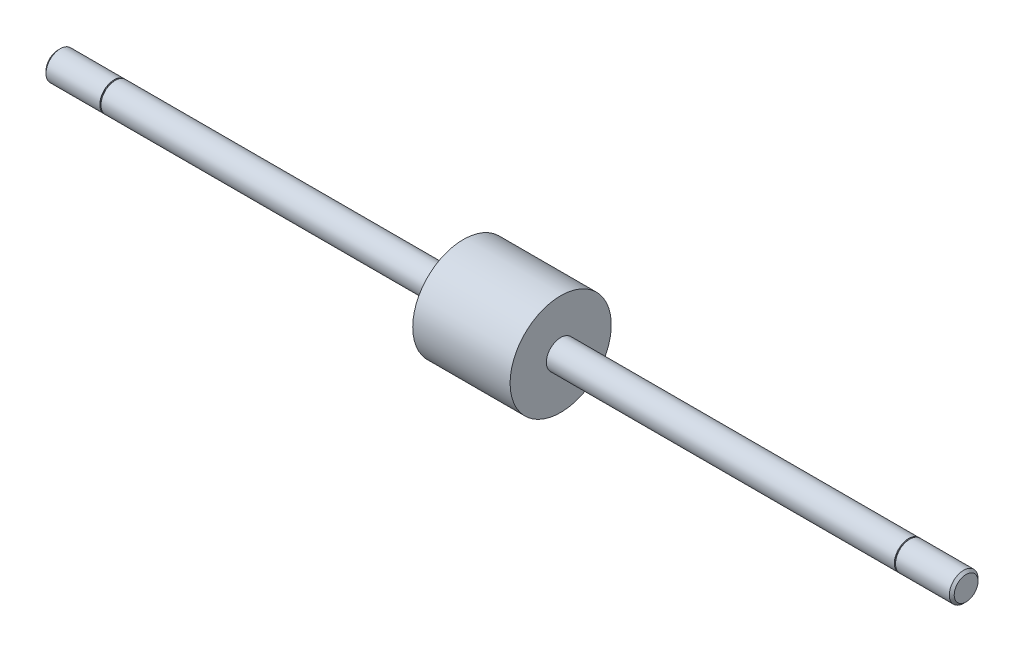
ISO-10303-21;
HEADER;
FILE_DESCRIPTION(('STEP AP214'),'2;1');
FILE_NAME('part.step','',(''),(''),'','','');
FILE_SCHEMA(('AUTOMOTIVE_DESIGN { 1 0 10303 214 1 1 1 1 }'));
ENDSEC;
DATA;
#1=APPLICATION_CONTEXT('core data for automotive mechanical design processes');
#2=APPLICATION_PROTOCOL_DEFINITION('international standard','automotive_design',2000,#1);
#3=PRODUCT_CONTEXT('',#1,'mechanical');
#4=PRODUCT('Part','Part','',(#3));
#5=PRODUCT_RELATED_PRODUCT_CATEGORY('part','',(#4));
#6=PRODUCT_DEFINITION_FORMATION('','',#4);
#7=PRODUCT_DEFINITION_CONTEXT('part definition',#1,'design');
#8=PRODUCT_DEFINITION('design','',#6,#7);
#9=PRODUCT_DEFINITION_SHAPE('','',#8);
#10=(LENGTH_UNIT() NAMED_UNIT(*) SI_UNIT(.MILLI.,.METRE.));
#11=(NAMED_UNIT(*) PLANE_ANGLE_UNIT() SI_UNIT($,.RADIAN.));
#12=(NAMED_UNIT(*) SI_UNIT($,.STERADIAN.) SOLID_ANGLE_UNIT());
#13=UNCERTAINTY_MEASURE_WITH_UNIT(LENGTH_MEASURE(1.E-05),#10,'distance_accuracy_value','');
#14=(GEOMETRIC_REPRESENTATION_CONTEXT(3) GLOBAL_UNCERTAINTY_ASSIGNED_CONTEXT((#13)) GLOBAL_UNIT_ASSIGNED_CONTEXT((#10,
#11,#12)) REPRESENTATION_CONTEXT('',''));
#15=CARTESIAN_POINT('',(0.,0.,0.));
#16=DIRECTION('',(0.,0.,1.));
#17=DIRECTION('',(1.,0.,0.));
#18=AXIS2_PLACEMENT_3D('',#15,#16,#17);
#19=CARTESIAN_POINT('',(175.514,0.,0.));
#20=DIRECTION('',(-1.,0.,0.));
#21=DIRECTION('',(0.,0.,1.));
#22=AXIS2_PLACEMENT_3D('',#19,#20,#21);
#23=CYLINDRICAL_SURFACE('',#22,3.175);
#24=CARTESIAN_POINT('',(98.5266,0.,0.));
#25=DIRECTION('',(-1.,0.,0.));
#26=DIRECTION('',(0.,0.,1.));
#27=AXIS2_PLACEMENT_3D('',#24,#25,#26);
#28=CIRCLE('',#27,3.175);
#29=CARTESIAN_POINT('',(98.5266,0.,3.175));
#30=VERTEX_POINT('',#29);
#31=EDGE_CURVE('E10',#30,#30,#28,.F.);
#32=ORIENTED_EDGE('',*,*,#31,.T.);
#33=EDGE_LOOP('',(#32));
#34=FACE_BOUND('',#33,.T.);
#35=CARTESIAN_POINT('',(175.514,0.,0.));
#36=DIRECTION('',(1.,0.,0.));
#37=DIRECTION('',(0.,0.,-1.));
#38=AXIS2_PLACEMENT_3D('',#35,#36,#37);
#39=CIRCLE('',#38,3.175);
#40=CARTESIAN_POINT('',(175.514,0.,-3.175));
#41=VERTEX_POINT('',#40);
#42=EDGE_CURVE('E40',#41,#41,#39,.T.);
#43=ORIENTED_EDGE('',*,*,#42,.F.);
#44=EDGE_LOOP('',(#43));
#45=FACE_BOUND('',#44,.T.);
#46=ADVANCED_FACE('F36',(#34,#45),#23,.T.);
#47=CARTESIAN_POINT('',(98.5266,0.,0.));
#48=DIRECTION('',(-1.,0.,0.));
#49=DIRECTION('',(0.,0.,1.));
#50=AXIS2_PLACEMENT_3D('',#47,#48,#49);
#51=CYLINDRICAL_SURFACE('',#50,3.175);
#52=CARTESIAN_POINT('',(76.9874,0.,0.));
#53=DIRECTION('',(-1.,0.,0.));
#54=DIRECTION('',(0.,0.,1.));
#55=AXIS2_PLACEMENT_3D('',#52,#53,#54);
#56=CIRCLE('',#55,3.175);
#57=CARTESIAN_POINT('',(76.9874,0.,3.175));
#58=VERTEX_POINT('',#57);
#59=EDGE_CURVE('E44',#58,#58,#56,.T.);
#60=ORIENTED_EDGE('',*,*,#59,.T.);
#61=EDGE_LOOP('',(#60));
#62=FACE_BOUND('',#61,.T.);
#63=CARTESIAN_POINT('',(0.,0.,0.));
#64=DIRECTION('',(-1.,0.,0.));
#65=DIRECTION('',(0.,0.,1.));
#66=AXIS2_PLACEMENT_3D('',#63,#64,#65);
#67=CIRCLE('',#66,3.175);
#68=CARTESIAN_POINT('',(0.,0.,3.175));
#69=VERTEX_POINT('',#68);
#70=EDGE_CURVE('E53',#69,#69,#67,.T.);
#71=ORIENTED_EDGE('',*,*,#70,.F.);
#72=EDGE_LOOP('',(#71));
#73=FACE_BOUND('',#72,.T.);
#74=ADVANCED_FACE('F107',(#62,#73),#51,.T.);
#75=CARTESIAN_POINT('',(98.5266,11.19505,0.));
#76=DIRECTION('',(-1.,0.,0.));
#77=DIRECTION('',(0.,0.,1.));
#78=AXIS2_PLACEMENT_3D('',#75,#76,#77);
#79=PLANE('',#78);
#80=CARTESIAN_POINT('',(98.5266,0.,0.));
#81=DIRECTION('',(-1.,0.,0.));
#82=DIRECTION('',(0.,0.,1.));
#83=AXIS2_PLACEMENT_3D('',#80,#81,#82);
#84=CIRCLE('',#83,11.19505);
#85=CARTESIAN_POINT('',(98.5266,0.,11.19505));
#86=VERTEX_POINT('',#85);
#87=EDGE_CURVE('E90',#86,#86,#84,.T.);
#88=ORIENTED_EDGE('',*,*,#87,.F.);
#89=EDGE_LOOP('',(#88));
#90=FACE_BOUND('',#89,.T.);
#91=ORIENTED_EDGE('',*,*,#31,.F.);
#92=EDGE_LOOP('',(#91));
#93=FACE_BOUND('',#92,.T.);
#94=ADVANCED_FACE('F104',(#90,#93),#79,.F.);
#95=CARTESIAN_POINT('',(76.9874,3.175,0.));
#96=DIRECTION('',(1.,0.,0.));
#97=DIRECTION('',(0.,0.,-1.));
#98=AXIS2_PLACEMENT_3D('',#95,#96,#97);
#99=PLANE('',#98);
#100=ORIENTED_EDGE('',*,*,#59,.F.);
#101=EDGE_LOOP('',(#100));
#102=FACE_BOUND('',#101,.T.);
#103=CARTESIAN_POINT('',(76.9874,0.,0.));
#104=DIRECTION('',(-1.,0.,0.));
#105=DIRECTION('',(0.,0.,1.));
#106=AXIS2_PLACEMENT_3D('',#103,#104,#105);
#107=CIRCLE('',#106,11.19505);
#108=CARTESIAN_POINT('',(76.9874,0.,11.19505));
#109=VERTEX_POINT('',#108);
#110=EDGE_CURVE('E49',#109,#109,#107,.T.);
#111=ORIENTED_EDGE('',*,*,#110,.T.);
#112=EDGE_LOOP('',(#111));
#113=FACE_BOUND('',#112,.T.);
#114=ADVANCED_FACE('F95',(#102,#113),#99,.F.);
#115=CARTESIAN_POINT('',(98.5266,0.,0.));
#116=DIRECTION('',(-1.,0.,0.));
#117=DIRECTION('',(0.,0.,1.));
#118=AXIS2_PLACEMENT_3D('',#115,#116,#117);
#119=CYLINDRICAL_SURFACE('',#118,11.19505);
#120=ORIENTED_EDGE('',*,*,#110,.F.);
#121=EDGE_LOOP('',(#120));
#122=FACE_BOUND('',#121,.T.);
#123=ORIENTED_EDGE('',*,*,#87,.T.);
#124=EDGE_LOOP('',(#123));
#125=FACE_BOUND('',#124,.T.);
#126=ADVANCED_FACE('F97',(#122,#125),#119,.T.);
#127=CARTESIAN_POINT('',(-0.254,3.429,0.));
#128=DIRECTION('',(1.,0.,0.));
#129=DIRECTION('',(0.,0.,-1.));
#130=AXIS2_PLACEMENT_3D('',#127,#128,#129);
#131=PLANE('',#130);
#132=CARTESIAN_POINT('',(-0.254,0.,0.));
#133=DIRECTION('',(-1.,0.,0.));
#134=DIRECTION('',(0.,0.,1.));
#135=AXIS2_PLACEMENT_3D('',#132,#133,#134);
#136=CIRCLE('',#135,2.921);
#137=CARTESIAN_POINT('',(-0.254,0.,2.921));
#138=VERTEX_POINT('',#137);
#139=EDGE_CURVE('E57',#138,#138,#136,.T.);
#140=ORIENTED_EDGE('',*,*,#139,.T.);
#141=EDGE_LOOP('',(#140));
#142=FACE_BOUND('',#141,.T.);
#143=CARTESIAN_POINT('',(-0.254000000000004,0.,0.));
#144=DIRECTION('',(1.,0.,0.));
#145=DIRECTION('',(0.,0.,-1.));
#146=AXIS2_PLACEMENT_3D('',#143,#144,#145);
#147=CIRCLE('',#146,3.175);
#148=CARTESIAN_POINT('',(-0.254000000000004,0.,-3.175));
#149=VERTEX_POINT('',#148);
#150=EDGE_CURVE('E56',#149,#149,#147,.T.);
#151=ORIENTED_EDGE('',*,*,#150,.T.);
#152=EDGE_LOOP('',(#151));
#153=FACE_BOUND('',#152,.T.);
#154=ADVANCED_FACE('F100',(#142,#153),#131,.T.);
#155=CARTESIAN_POINT('',(0.,2.921,0.));
#156=DIRECTION('',(-1.,0.,0.));
#157=DIRECTION('',(0.,0.,1.));
#158=AXIS2_PLACEMENT_3D('',#155,#156,#157);
#159=PLANE('',#158);
#160=CARTESIAN_POINT('',(0.,0.,0.));
#161=DIRECTION('',(-1.,0.,0.));
#162=DIRECTION('',(0.,0.,1.));
#163=AXIS2_PLACEMENT_3D('',#160,#161,#162);
#164=CIRCLE('',#163,2.921);
#165=CARTESIAN_POINT('',(0.,0.,2.921));
#166=VERTEX_POINT('',#165);
#167=EDGE_CURVE('E66',#166,#166,#164,.T.);
#168=ORIENTED_EDGE('',*,*,#167,.F.);
#169=EDGE_LOOP('',(#168));
#170=FACE_BOUND('',#169,.T.);
#171=ORIENTED_EDGE('',*,*,#70,.T.);
#172=EDGE_LOOP('',(#171));
#173=FACE_BOUND('',#172,.T.);
#174=ADVANCED_FACE('F149',(#170,#173),#159,.T.);
#175=CARTESIAN_POINT('',(0.,0.,0.));
#176=DIRECTION('',(-1.,0.,0.));
#177=DIRECTION('',(0.,0.,1.));
#178=AXIS2_PLACEMENT_3D('',#175,#176,#177);
#179=CYLINDRICAL_SURFACE('',#178,2.921);
#180=ORIENTED_EDGE('',*,*,#167,.T.);
#181=EDGE_LOOP('',(#180));
#182=FACE_BOUND('',#181,.T.);
#183=ORIENTED_EDGE('',*,*,#139,.F.);
#184=EDGE_LOOP('',(#183));
#185=FACE_BOUND('',#184,.T.);
#186=ADVANCED_FACE('F151',(#182,#185),#179,.T.);
#187=CARTESIAN_POINT('',(-12.7,0.,0.));
#188=DIRECTION('',(1.,0.,0.));
#189=DIRECTION('',(0.,0.,-1.));
#190=AXIS2_PLACEMENT_3D('',#187,#188,#189);
#191=PLANE('',#190);
#192=CARTESIAN_POINT('',(-12.7,0.,0.));
#193=DIRECTION('',(-1.,0.,0.));
#194=DIRECTION('',(0.,0.,1.));
#195=AXIS2_PLACEMENT_3D('',#192,#193,#194);
#196=CIRCLE('',#195,2.63398);
#197=CARTESIAN_POINT('',(-12.7,0.,2.63398));
#198=VERTEX_POINT('',#197);
#199=EDGE_CURVE('E87',#198,#198,#196,.T.);
#200=ORIENTED_EDGE('',*,*,#199,.T.);
#201=EDGE_LOOP('',(#200));
#202=FACE_BOUND('',#201,.T.);
#203=ADVANCED_FACE('F154',(#202),#191,.F.);
#204=CARTESIAN_POINT('',(-12.15898,0.,0.));
#205=DIRECTION('',(1.,0.,0.));
#206=DIRECTION('',(0.,0.,-1.));
#207=AXIS2_PLACEMENT_3D('',#204,#205,#206);
#208=CONICAL_SURFACE('',#207,3.175,0.785398163397448);
#209=ORIENTED_EDGE('',*,*,#199,.F.);
#210=EDGE_LOOP('',(#209));
#211=FACE_BOUND('',#210,.T.);
#212=CARTESIAN_POINT('',(-12.15898,0.,0.));
#213=DIRECTION('',(-1.,0.,0.));
#214=DIRECTION('',(0.,0.,1.));
#215=AXIS2_PLACEMENT_3D('',#212,#213,#214);
#216=CIRCLE('',#215,3.175);
#217=CARTESIAN_POINT('',(-12.15898,0.,3.175));
#218=VERTEX_POINT('',#217);
#219=EDGE_CURVE('E84',#218,#218,#216,.T.);
#220=ORIENTED_EDGE('',*,*,#219,.T.);
#221=EDGE_LOOP('',(#220));
#222=FACE_BOUND('',#221,.T.);
#223=ADVANCED_FACE('F219',(#211,#222),#208,.T.);
#224=ORIENTED_EDGE('',*,*,#219,.F.);
#225=EDGE_LOOP('',(#224));
#226=FACE_BOUND('',#225,.T.);
#227=ORIENTED_EDGE('',*,*,#150,.F.);
#228=EDGE_LOOP('',(#227));
#229=FACE_BOUND('',#228,.T.);
#230=ADVANCED_FACE('F38',(#226,#229),#51,.T.);
#231=CARTESIAN_POINT('',(175.514,3.429,0.));
#232=DIRECTION('',(1.,0.,0.));
#233=DIRECTION('',(0.,0.,-1.));
#234=AXIS2_PLACEMENT_3D('',#231,#232,#233);
#235=PLANE('',#234);
#236=CARTESIAN_POINT('',(175.514,0.,0.));
#237=DIRECTION('',(-1.,0.,0.));
#238=DIRECTION('',(0.,0.,1.));
#239=AXIS2_PLACEMENT_3D('',#236,#237,#238);
#240=CIRCLE('',#239,2.921);
#241=CARTESIAN_POINT('',(175.514,0.,2.921));
#242=VERTEX_POINT('',#241);
#243=EDGE_CURVE('E62',#242,#242,#240,.T.);
#244=ORIENTED_EDGE('',*,*,#243,.T.);
#245=EDGE_LOOP('',(#244));
#246=FACE_BOUND('',#245,.T.);
#247=ORIENTED_EDGE('',*,*,#42,.T.);
#248=EDGE_LOOP('',(#247));
#249=FACE_BOUND('',#248,.T.);
#250=ADVANCED_FACE('F159',(#246,#249),#235,.T.);
#251=CARTESIAN_POINT('',(175.768,2.921,0.));
#252=DIRECTION('',(-1.,0.,0.));
#253=DIRECTION('',(0.,0.,1.));
#254=AXIS2_PLACEMENT_3D('',#251,#252,#253);
#255=PLANE('',#254);
#256=CARTESIAN_POINT('',(175.768,0.,0.));
#257=DIRECTION('',(-1.,0.,0.));
#258=DIRECTION('',(0.,0.,1.));
#259=AXIS2_PLACEMENT_3D('',#256,#257,#258);
#260=CIRCLE('',#259,2.921);
#261=CARTESIAN_POINT('',(175.768,0.,2.921));
#262=VERTEX_POINT('',#261);
#263=EDGE_CURVE('E68',#262,#262,#260,.T.);
#264=ORIENTED_EDGE('',*,*,#263,.F.);
#265=EDGE_LOOP('',(#264));
#266=FACE_BOUND('',#265,.T.);
#267=CARTESIAN_POINT('',(175.768,0.,0.));
#268=DIRECTION('',(-1.,0.,0.));
#269=DIRECTION('',(0.,0.,1.));
#270=AXIS2_PLACEMENT_3D('',#267,#268,#269);
#271=CIRCLE('',#270,3.175);
#272=CARTESIAN_POINT('',(175.768,0.,3.175));
#273=VERTEX_POINT('',#272);
#274=EDGE_CURVE('E60',#273,#273,#271,.T.);
#275=ORIENTED_EDGE('',*,*,#274,.T.);
#276=EDGE_LOOP('',(#275));
#277=FACE_BOUND('',#276,.T.);
#278=ADVANCED_FACE('F143',(#266,#277),#255,.T.);
#279=CARTESIAN_POINT('',(175.768,0.,0.));
#280=DIRECTION('',(-1.,0.,0.));
#281=DIRECTION('',(0.,0.,1.));
#282=AXIS2_PLACEMENT_3D('',#279,#280,#281);
#283=CYLINDRICAL_SURFACE('',#282,2.921);
#284=ORIENTED_EDGE('',*,*,#263,.T.);
#285=EDGE_LOOP('',(#284));
#286=FACE_BOUND('',#285,.T.);
#287=ORIENTED_EDGE('',*,*,#243,.F.);
#288=EDGE_LOOP('',(#287));
#289=FACE_BOUND('',#288,.T.);
#290=ADVANCED_FACE('F138',(#286,#289),#283,.T.);
#291=CARTESIAN_POINT('',(188.214,2.63398,0.));
#292=DIRECTION('',(-1.,0.,0.));
#293=DIRECTION('',(0.,0.,1.));
#294=AXIS2_PLACEMENT_3D('',#291,#292,#293);
#295=PLANE('',#294);
#296=CARTESIAN_POINT('',(188.214,0.,0.));
#297=DIRECTION('',(-1.,0.,0.));
#298=DIRECTION('',(0.,0.,1.));
#299=AXIS2_PLACEMENT_3D('',#296,#297,#298);
#300=CIRCLE('',#299,2.63398);
#301=CARTESIAN_POINT('',(188.214,0.,2.63398));
#302=VERTEX_POINT('',#301);
#303=EDGE_CURVE('E59',#302,#302,#300,.T.);
#304=ORIENTED_EDGE('',*,*,#303,.F.);
#305=EDGE_LOOP('',(#304));
#306=FACE_BOUND('',#305,.T.);
#307=ADVANCED_FACE('F130',(#306),#295,.F.);
#308=CARTESIAN_POINT('',(188.214,0.,0.));
#309=DIRECTION('',(-1.,0.,0.));
#310=DIRECTION('',(0.,0.,1.));
#311=AXIS2_PLACEMENT_3D('',#308,#309,#310);
#312=CONICAL_SURFACE('',#311,2.63398,0.785398163397445);
#313=CARTESIAN_POINT('',(187.67298,0.,0.));
#314=DIRECTION('',(-1.,0.,0.));
#315=DIRECTION('',(0.,0.,1.));
#316=AXIS2_PLACEMENT_3D('',#313,#314,#315);
#317=CIRCLE('',#316,3.175);
#318=CARTESIAN_POINT('',(187.67298,0.,3.175));
#319=VERTEX_POINT('',#318);
#320=EDGE_CURVE('E81',#319,#319,#317,.T.);
#321=ORIENTED_EDGE('',*,*,#320,.F.);
#322=EDGE_LOOP('',(#321));
#323=FACE_BOUND('',#322,.T.);
#324=ORIENTED_EDGE('',*,*,#303,.T.);
#325=EDGE_LOOP('',(#324));
#326=FACE_BOUND('',#325,.T.);
#327=ADVANCED_FACE('F125',(#323,#326),#312,.T.);
#328=ORIENTED_EDGE('',*,*,#320,.T.);
#329=EDGE_LOOP('',(#328));
#330=FACE_BOUND('',#329,.T.);
#331=ORIENTED_EDGE('',*,*,#274,.F.);
#332=EDGE_LOOP('',(#331));
#333=FACE_BOUND('',#332,.T.);
#334=ADVANCED_FACE('F118',(#330,#333),#23,.T.);
#335=CLOSED_SHELL('',(#46,#74,#94,#114,#126,#154,#174,#186,#203,#223,#230,#250,#278,#290,#307,
#327,#334));
#336=MANIFOLD_SOLID_BREP('B2',#335);
#337=ADVANCED_BREP_SHAPE_REPRESENTATION('',(#18,#336),#14);
#338=SHAPE_DEFINITION_REPRESENTATION(#9,#337);
ENDSEC;
END-ISO-10303-21;
